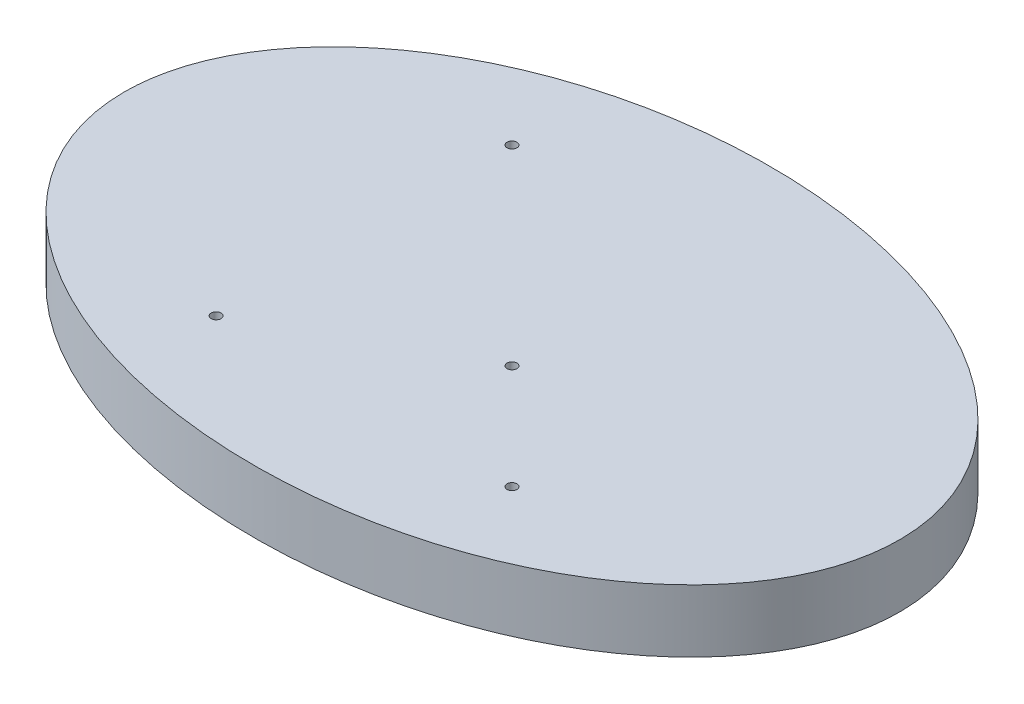
ISO-10303-21;
HEADER;
FILE_DESCRIPTION(('STEP AP214'),'2;1');
FILE_NAME('part.step','',(''),(''),'','','');
FILE_SCHEMA(('AUTOMOTIVE_DESIGN { 1 0 10303 214 1 1 1 1 }'));
ENDSEC;
DATA;
#1=APPLICATION_CONTEXT('core data for automotive mechanical design processes');
#2=APPLICATION_PROTOCOL_DEFINITION('international standard','automotive_design',2000,#1);
#3=PRODUCT_CONTEXT('',#1,'mechanical');
#4=PRODUCT('Part','Part','',(#3));
#5=PRODUCT_RELATED_PRODUCT_CATEGORY('part','',(#4));
#6=PRODUCT_DEFINITION_FORMATION('','',#4);
#7=PRODUCT_DEFINITION_CONTEXT('part definition',#1,'design');
#8=PRODUCT_DEFINITION('design','',#6,#7);
#9=PRODUCT_DEFINITION_SHAPE('','',#8);
#10=(LENGTH_UNIT() NAMED_UNIT(*) SI_UNIT(.MILLI.,.METRE.));
#11=(NAMED_UNIT(*) PLANE_ANGLE_UNIT() SI_UNIT($,.RADIAN.));
#12=(NAMED_UNIT(*) SI_UNIT($,.STERADIAN.) SOLID_ANGLE_UNIT());
#13=UNCERTAINTY_MEASURE_WITH_UNIT(LENGTH_MEASURE(1.E-05),#10,'distance_accuracy_value','');
#14=(GEOMETRIC_REPRESENTATION_CONTEXT(3) GLOBAL_UNCERTAINTY_ASSIGNED_CONTEXT((#13)) GLOBAL_UNIT_ASSIGNED_CONTEXT((#10,
#11,#12)) REPRESENTATION_CONTEXT('',''));
#15=CARTESIAN_POINT('',(0.,0.,0.));
#16=DIRECTION('',(0.,0.,1.));
#17=DIRECTION('',(1.,0.,0.));
#18=AXIS2_PLACEMENT_3D('',#15,#16,#17);
#19=CARTESIAN_POINT('',(0.,0.,0.));
#20=DIRECTION('',(0.,1.,0.));
#21=DIRECTION('',(0.,0.,1.));
#22=AXIS2_PLACEMENT_3D('',#19,#20,#21);
#23=PLANE('',#22);
#24=CARTESIAN_POINT('',(-30.,0.,30.));
#25=DIRECTION('',(0.,1.,0.));
#26=DIRECTION('',(0.,0.,1.));
#27=AXIS2_PLACEMENT_3D('',#24,#25,#26);
#28=CIRCLE('',#27,0.999999999999998);
#29=CARTESIAN_POINT('',(-30.,0.,31.));
#30=VERTEX_POINT('',#29);
#31=EDGE_CURVE('E58',#30,#30,#28,.T.);
#32=ORIENTED_EDGE('',*,*,#31,.T.);
#33=EDGE_LOOP('',(#32));
#34=FACE_BOUND('',#33,.T.);
#35=CARTESIAN_POINT('',(-30.,0.,-30.));
#36=DIRECTION('',(0.,1.,0.));
#37=DIRECTION('',(0.,0.,1.));
#38=AXIS2_PLACEMENT_3D('',#35,#36,#37);
#39=CIRCLE('',#38,0.999999999999998);
#40=CARTESIAN_POINT('',(-30.,0.,-29.));
#41=VERTEX_POINT('',#40);
#42=EDGE_CURVE('E46',#41,#41,#39,.T.);
#43=ORIENTED_EDGE('',*,*,#42,.T.);
#44=EDGE_LOOP('',(#43));
#45=FACE_BOUND('',#44,.T.);
#46=CARTESIAN_POINT('',(0.,0.,0.));
#47=DIRECTION('',(0.,1.,0.));
#48=DIRECTION('',(-1.,0.,0.));
#49=AXIS2_PLACEMENT_3D('',#46,#47,#48);
#50=ELLIPSE('',#49,78.6396103067893,52.4264068711929);
#51=CARTESIAN_POINT('',(-78.6396103067893,0.,0.));
#52=VERTEX_POINT('',#51);
#53=EDGE_CURVE('E39',#52,#52,#50,.T.);
#54=ORIENTED_EDGE('',*,*,#53,.F.);
#55=EDGE_LOOP('',(#54));
#56=FACE_BOUND('',#55,.T.);
#57=CARTESIAN_POINT('',(30.,0.,30.));
#58=DIRECTION('',(0.,1.,0.));
#59=DIRECTION('',(0.,0.,1.));
#60=AXIS2_PLACEMENT_3D('',#57,#58,#59);
#61=CIRCLE('',#60,0.999999999999998);
#62=CARTESIAN_POINT('',(30.,0.,31.));
#63=VERTEX_POINT('',#62);
#64=EDGE_CURVE('E52',#63,#63,#61,.T.);
#65=ORIENTED_EDGE('',*,*,#64,.T.);
#66=EDGE_LOOP('',(#65));
#67=FACE_BOUND('',#66,.T.);
#68=CARTESIAN_POINT('',(8.78679656440357,0.,8.78679656440358));
#69=DIRECTION('',(0.,1.,0.));
#70=DIRECTION('',(0.,0.,1.));
#71=AXIS2_PLACEMENT_3D('',#68,#69,#70);
#72=CIRCLE('',#71,1.);
#73=CARTESIAN_POINT('',(8.78679656440357,0.,9.78679656440358));
#74=VERTEX_POINT('',#73);
#75=EDGE_CURVE('E64',#74,#74,#72,.T.);
#76=ORIENTED_EDGE('',*,*,#75,.T.);
#77=EDGE_LOOP('',(#76));
#78=FACE_BOUND('',#77,.T.);
#79=ADVANCED_FACE('F31',(#34,#45,#56,#67,#78),#23,.F.);
#80=CARTESIAN_POINT('',(0.,12.7,0.));
#81=DIRECTION('',(0.,1.,0.));
#82=DIRECTION('',(0.,0.,1.));
#83=AXIS2_PLACEMENT_3D('',#80,#81,#82);
#84=PLANE('',#83);
#85=CARTESIAN_POINT('',(-30.,12.7,30.));
#86=DIRECTION('',(0.,1.,0.));
#87=DIRECTION('',(0.,0.,1.));
#88=AXIS2_PLACEMENT_3D('',#85,#86,#87);
#89=CIRCLE('',#88,0.999999999999998);
#90=CARTESIAN_POINT('',(-30.,12.7,31.));
#91=VERTEX_POINT('',#90);
#92=EDGE_CURVE('E55',#91,#91,#89,.T.);
#93=ORIENTED_EDGE('',*,*,#92,.F.);
#94=EDGE_LOOP('',(#93));
#95=FACE_BOUND('',#94,.T.);
#96=CARTESIAN_POINT('',(-30.,12.7,-30.));
#97=DIRECTION('',(0.,1.,0.));
#98=DIRECTION('',(0.,0.,1.));
#99=AXIS2_PLACEMENT_3D('',#96,#97,#98);
#100=CIRCLE('',#99,0.999999999999998);
#101=CARTESIAN_POINT('',(-30.,12.7,-29.));
#102=VERTEX_POINT('',#101);
#103=EDGE_CURVE('E43',#102,#102,#100,.T.);
#104=ORIENTED_EDGE('',*,*,#103,.F.);
#105=EDGE_LOOP('',(#104));
#106=FACE_BOUND('',#105,.T.);
#107=CARTESIAN_POINT('',(0.,12.7,0.));
#108=DIRECTION('',(0.,1.,0.));
#109=DIRECTION('',(-1.,0.,0.));
#110=AXIS2_PLACEMENT_3D('',#107,#108,#109);
#111=ELLIPSE('',#110,78.6396103067893,52.4264068711929);
#112=CARTESIAN_POINT('',(-78.6396103067893,12.7,0.));
#113=VERTEX_POINT('',#112);
#114=EDGE_CURVE('E10',#113,#113,#111,.T.);
#115=ORIENTED_EDGE('',*,*,#114,.T.);
#116=EDGE_LOOP('',(#115));
#117=FACE_BOUND('',#116,.T.);
#118=CARTESIAN_POINT('',(30.,12.7,30.));
#119=DIRECTION('',(0.,1.,0.));
#120=DIRECTION('',(0.,0.,1.));
#121=AXIS2_PLACEMENT_3D('',#118,#119,#120);
#122=CIRCLE('',#121,0.999999999999998);
#123=CARTESIAN_POINT('',(30.,12.7,31.));
#124=VERTEX_POINT('',#123);
#125=EDGE_CURVE('E49',#124,#124,#122,.T.);
#126=ORIENTED_EDGE('',*,*,#125,.F.);
#127=EDGE_LOOP('',(#126));
#128=FACE_BOUND('',#127,.T.);
#129=CARTESIAN_POINT('',(8.78679656440357,12.7,8.78679656440358));
#130=DIRECTION('',(0.,1.,0.));
#131=DIRECTION('',(0.,0.,1.));
#132=AXIS2_PLACEMENT_3D('',#129,#130,#131);
#133=CIRCLE('',#132,1.);
#134=CARTESIAN_POINT('',(8.78679656440357,12.7,9.78679656440358));
#135=VERTEX_POINT('',#134);
#136=EDGE_CURVE('E61',#135,#135,#133,.T.);
#137=ORIENTED_EDGE('',*,*,#136,.F.);
#138=EDGE_LOOP('',(#137));
#139=FACE_BOUND('',#138,.T.);
#140=ADVANCED_FACE('F33',(#95,#106,#117,#128,#139),#84,.T.);
#141=CARTESIAN_POINT('',(0.,201.726098162423,0.));
#142=DIRECTION('',(0.,1.,0.));
#143=DIRECTION('',(-1.,0.,0.));
#144=AXIS2_PLACEMENT_3D('',#141,#142,#143);
#145=ELLIPSE('',#144,78.6396103067893,52.4264068711929);
#146=DIRECTION('',(0.,-1.,0.));
#147=VECTOR('',#146,1.);
#148=SURFACE_OF_LINEAR_EXTRUSION('',#145,#147);
#149=ORIENTED_EDGE('',*,*,#53,.T.);
#150=EDGE_LOOP('',(#149));
#151=FACE_BOUND('',#150,.T.);
#152=ORIENTED_EDGE('',*,*,#114,.F.);
#153=EDGE_LOOP('',(#152));
#154=FACE_BOUND('',#153,.T.);
#155=ADVANCED_FACE('F74',(#151,#154),#148,.F.);
#156=CARTESIAN_POINT('',(-30.,12.7,-30.));
#157=DIRECTION('',(0.,-1.,0.));
#158=DIRECTION('',(0.,0.,-1.));
#159=AXIS2_PLACEMENT_3D('',#156,#157,#158);
#160=CYLINDRICAL_SURFACE('',#159,0.999999999999998);
#161=ORIENTED_EDGE('',*,*,#103,.T.);
#162=EDGE_LOOP('',(#161));
#163=FACE_BOUND('',#162,.T.);
#164=ORIENTED_EDGE('',*,*,#42,.F.);
#165=EDGE_LOOP('',(#164));
#166=FACE_BOUND('',#165,.T.);
#167=ADVANCED_FACE('F80',(#163,#166),#160,.F.);
#168=CARTESIAN_POINT('',(30.,12.7,30.));
#169=DIRECTION('',(0.,-1.,0.));
#170=DIRECTION('',(0.,0.,-1.));
#171=AXIS2_PLACEMENT_3D('',#168,#169,#170);
#172=CYLINDRICAL_SURFACE('',#171,0.999999999999998);
#173=ORIENTED_EDGE('',*,*,#125,.T.);
#174=EDGE_LOOP('',(#173));
#175=FACE_BOUND('',#174,.T.);
#176=ORIENTED_EDGE('',*,*,#64,.F.);
#177=EDGE_LOOP('',(#176));
#178=FACE_BOUND('',#177,.T.);
#179=ADVANCED_FACE('F90',(#175,#178),#172,.F.);
#180=CARTESIAN_POINT('',(-30.,12.7,30.));
#181=DIRECTION('',(0.,-1.,0.));
#182=DIRECTION('',(0.,0.,-1.));
#183=AXIS2_PLACEMENT_3D('',#180,#181,#182);
#184=CYLINDRICAL_SURFACE('',#183,0.999999999999998);
#185=ORIENTED_EDGE('',*,*,#92,.T.);
#186=EDGE_LOOP('',(#185));
#187=FACE_BOUND('',#186,.T.);
#188=ORIENTED_EDGE('',*,*,#31,.F.);
#189=EDGE_LOOP('',(#188));
#190=FACE_BOUND('',#189,.T.);
#191=ADVANCED_FACE('F93',(#187,#190),#184,.F.);
#192=CARTESIAN_POINT('',(8.78679656440357,12.7,8.78679656440358));
#193=DIRECTION('',(0.,-1.,0.));
#194=DIRECTION('',(0.,0.,-1.));
#195=AXIS2_PLACEMENT_3D('',#192,#193,#194);
#196=CYLINDRICAL_SURFACE('',#195,1.);
#197=ORIENTED_EDGE('',*,*,#136,.T.);
#198=EDGE_LOOP('',(#197));
#199=FACE_BOUND('',#198,.T.);
#200=ORIENTED_EDGE('',*,*,#75,.F.);
#201=EDGE_LOOP('',(#200));
#202=FACE_BOUND('',#201,.T.);
#203=ADVANCED_FACE('F70',(#199,#202),#196,.F.);
#204=CLOSED_SHELL('',(#79,#140,#155,#167,#179,#191,#203));
#205=MANIFOLD_SOLID_BREP('B2',#204);
#206=ADVANCED_BREP_SHAPE_REPRESENTATION('',(#18,#205),#14);
#207=SHAPE_DEFINITION_REPRESENTATION(#9,#206);
ENDSEC;
END-ISO-10303-21;
